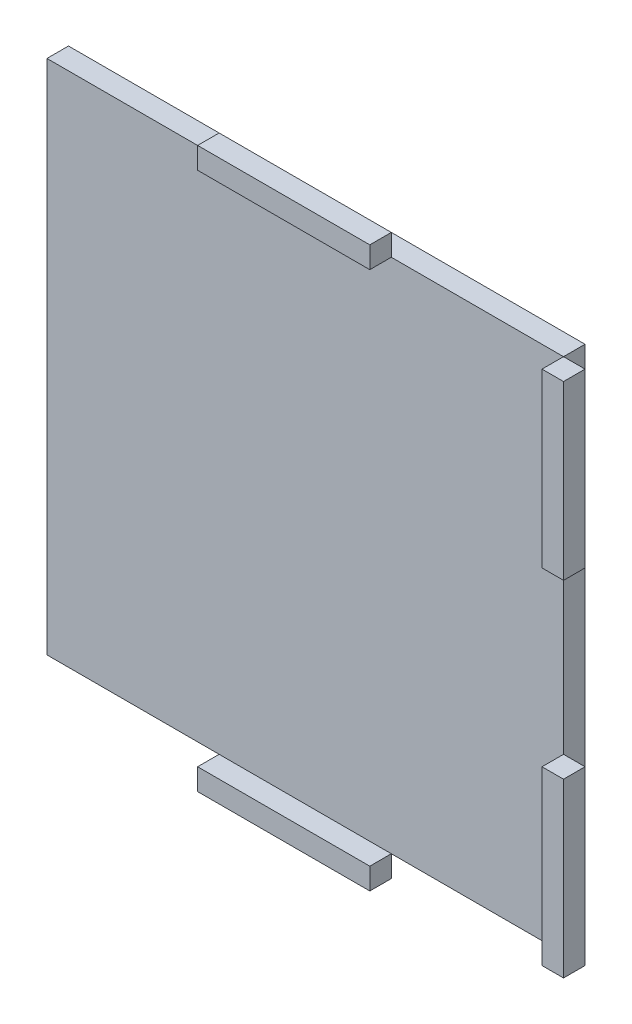
ISO-10303-21;
HEADER;
FILE_DESCRIPTION(('STEP AP214'),'2;1');
FILE_NAME('part.step','',(''),(''),'','','');
FILE_SCHEMA(('AUTOMOTIVE_DESIGN { 1 0 10303 214 1 1 1 1 }'));
ENDSEC;
DATA;
#1=APPLICATION_CONTEXT('core data for automotive mechanical design processes');
#2=APPLICATION_PROTOCOL_DEFINITION('international standard','automotive_design',2000,#1);
#3=PRODUCT_CONTEXT('',#1,'mechanical');
#4=PRODUCT('Part','Part','',(#3));
#5=PRODUCT_RELATED_PRODUCT_CATEGORY('part','',(#4));
#6=PRODUCT_DEFINITION_FORMATION('','',#4);
#7=PRODUCT_DEFINITION_CONTEXT('part definition',#1,'design');
#8=PRODUCT_DEFINITION('design','',#6,#7);
#9=PRODUCT_DEFINITION_SHAPE('','',#8);
#10=(LENGTH_UNIT() NAMED_UNIT(*) SI_UNIT(.MILLI.,.METRE.));
#11=(NAMED_UNIT(*) PLANE_ANGLE_UNIT() SI_UNIT($,.RADIAN.));
#12=(NAMED_UNIT(*) SI_UNIT($,.STERADIAN.) SOLID_ANGLE_UNIT());
#13=UNCERTAINTY_MEASURE_WITH_UNIT(LENGTH_MEASURE(1.E-05),#10,'distance_accuracy_value','');
#14=(GEOMETRIC_REPRESENTATION_CONTEXT(3) GLOBAL_UNCERTAINTY_ASSIGNED_CONTEXT((#13)) GLOBAL_UNIT_ASSIGNED_CONTEXT((#10,
#11,#12)) REPRESENTATION_CONTEXT('',''));
#15=CARTESIAN_POINT('',(0.,0.,0.));
#16=DIRECTION('',(0.,0.,1.));
#17=DIRECTION('',(1.,0.,0.));
#18=AXIS2_PLACEMENT_3D('',#15,#16,#17);
#19=CARTESIAN_POINT('',(-12.7,38.1,6.35));
#20=DIRECTION('',(1.,0.,0.));
#21=DIRECTION('',(0.,0.,-1.));
#22=AXIS2_PLACEMENT_3D('',#19,#20,#21);
#23=PLANE('',#22);
#24=DIRECTION('',(0.,-1.,0.));
#25=VECTOR('',#24,1.);
#26=CARTESIAN_POINT('',(-12.7,38.1,3.175));
#27=LINE('',#26,#25);
#28=CARTESIAN_POINT('',(-12.7,41.275,3.175));
#29=VERTEX_POINT('',#28);
#30=CARTESIAN_POINT('',(-12.7,38.1,3.175));
#31=VERTEX_POINT('',#30);
#32=EDGE_CURVE('E113',#29,#31,#27,.T.);
#33=ORIENTED_EDGE('',*,*,#32,.T.);
#34=DIRECTION('',(0.,0.,-1.));
#35=VECTOR('',#34,1.);
#36=CARTESIAN_POINT('',(-12.7,38.1,6.35));
#37=LINE('',#36,#35);
#38=CARTESIAN_POINT('',(-12.7,38.1,6.35));
#39=VERTEX_POINT('',#38);
#40=EDGE_CURVE('E12',#39,#31,#37,.T.);
#41=ORIENTED_EDGE('',*,*,#40,.F.);
#42=DIRECTION('',(0.,-1.,0.));
#43=VECTOR('',#42,1.);
#44=CARTESIAN_POINT('',(-12.7,38.1,6.35));
#45=LINE('',#44,#43);
#46=CARTESIAN_POINT('',(-12.7,41.275,6.35));
#47=VERTEX_POINT('',#46);
#48=EDGE_CURVE('E101',#47,#39,#45,.T.);
#49=ORIENTED_EDGE('',*,*,#48,.F.);
#50=DIRECTION('',(0.,0.,-1.));
#51=VECTOR('',#50,1.);
#52=CARTESIAN_POINT('',(-12.7,41.275,6.35));
#53=LINE('',#52,#51);
#54=EDGE_CURVE('E109',#47,#29,#53,.T.);
#55=ORIENTED_EDGE('',*,*,#54,.T.);
#56=EDGE_LOOP('',(#33,#41,#49,#55));
#57=FACE_BOUND('',#56,.T.);
#58=ADVANCED_FACE('F50',(#57),#23,.F.);
#59=CARTESIAN_POINT('',(-12.7,38.1,6.35));
#60=DIRECTION('',(0.,1.,0.));
#61=DIRECTION('',(0.,0.,1.));
#62=AXIS2_PLACEMENT_3D('',#59,#60,#61);
#63=PLANE('',#62);
#64=DIRECTION('',(1.,0.,0.));
#65=VECTOR('',#64,1.);
#66=CARTESIAN_POINT('',(-12.7,38.1,3.175));
#67=LINE('',#66,#65);
#68=CARTESIAN_POINT('',(12.7,38.1,3.175));
#69=VERTEX_POINT('',#68);
#70=EDGE_CURVE('E105',#31,#69,#67,.T.);
#71=ORIENTED_EDGE('',*,*,#70,.T.);
#72=DIRECTION('',(0.,0.,-1.));
#73=VECTOR('',#72,1.);
#74=CARTESIAN_POINT('',(12.7,38.1,6.35));
#75=LINE('',#74,#73);
#76=CARTESIAN_POINT('',(12.7,38.1,6.35));
#77=VERTEX_POINT('',#76);
#78=EDGE_CURVE('E58',#77,#69,#75,.T.);
#79=ORIENTED_EDGE('',*,*,#78,.F.);
#80=DIRECTION('',(1.,0.,0.));
#81=VECTOR('',#80,1.);
#82=CARTESIAN_POINT('',(-12.7,38.1,6.35));
#83=LINE('',#82,#81);
#84=EDGE_CURVE('E96',#39,#77,#83,.T.);
#85=ORIENTED_EDGE('',*,*,#84,.F.);
#86=ORIENTED_EDGE('',*,*,#40,.T.);
#87=EDGE_LOOP('',(#71,#79,#85,#86));
#88=FACE_BOUND('',#87,.T.);
#89=ADVANCED_FACE('F104',(#88),#63,.F.);
#90=CARTESIAN_POINT('',(12.7,38.1,6.35));
#91=DIRECTION('',(-1.,0.,0.));
#92=DIRECTION('',(0.,0.,1.));
#93=AXIS2_PLACEMENT_3D('',#90,#91,#92);
#94=PLANE('',#93);
#95=DIRECTION('',(0.,1.,0.));
#96=VECTOR('',#95,1.);
#97=CARTESIAN_POINT('',(12.7,38.1,3.175));
#98=LINE('',#97,#96);
#99=CARTESIAN_POINT('',(12.7,41.275,3.175));
#100=VERTEX_POINT('',#99);
#101=EDGE_CURVE('E83',#69,#100,#98,.T.);
#102=ORIENTED_EDGE('',*,*,#101,.T.);
#103=DIRECTION('',(0.,0.,-1.));
#104=VECTOR('',#103,1.);
#105=CARTESIAN_POINT('',(12.7,41.275,6.35));
#106=LINE('',#105,#104);
#107=CARTESIAN_POINT('',(12.7,41.275,6.35));
#108=VERTEX_POINT('',#107);
#109=EDGE_CURVE('E106',#108,#100,#106,.T.);
#110=ORIENTED_EDGE('',*,*,#109,.F.);
#111=DIRECTION('',(0.,1.,0.));
#112=VECTOR('',#111,1.);
#113=CARTESIAN_POINT('',(12.7,38.1,6.35));
#114=LINE('',#113,#112);
#115=EDGE_CURVE('E99',#77,#108,#114,.T.);
#116=ORIENTED_EDGE('',*,*,#115,.F.);
#117=ORIENTED_EDGE('',*,*,#78,.T.);
#118=EDGE_LOOP('',(#102,#110,#116,#117));
#119=FACE_BOUND('',#118,.T.);
#120=ADVANCED_FACE('F107',(#119),#94,.F.);
#121=CARTESIAN_POINT('',(-12.7,41.275,6.35));
#122=DIRECTION('',(0.,-1.,0.));
#123=DIRECTION('',(0.,0.,-1.));
#124=AXIS2_PLACEMENT_3D('',#121,#122,#123);
#125=PLANE('',#124);
#126=DIRECTION('',(-1.,0.,0.));
#127=VECTOR('',#126,1.);
#128=CARTESIAN_POINT('',(-12.7,41.275,3.175));
#129=LINE('',#128,#127);
#130=EDGE_CURVE('E89',#100,#29,#129,.T.);
#131=ORIENTED_EDGE('',*,*,#130,.T.);
#132=ORIENTED_EDGE('',*,*,#54,.F.);
#133=DIRECTION('',(-1.,0.,0.));
#134=VECTOR('',#133,1.);
#135=CARTESIAN_POINT('',(-12.7,41.275,6.35));
#136=LINE('',#135,#134);
#137=EDGE_CURVE('E66',#108,#47,#136,.T.);
#138=ORIENTED_EDGE('',*,*,#137,.F.);
#139=ORIENTED_EDGE('',*,*,#109,.T.);
#140=EDGE_LOOP('',(#131,#132,#138,#139));
#141=FACE_BOUND('',#140,.T.);
#142=ADVANCED_FACE('F120',(#141),#125,.F.);
#143=CARTESIAN_POINT('',(0.,0.,6.35));
#144=DIRECTION('',(0.,0.,-1.));
#145=DIRECTION('',(-1.,0.,0.));
#146=AXIS2_PLACEMENT_3D('',#143,#144,#145);
#147=PLANE('',#146);
#148=ORIENTED_EDGE('',*,*,#48,.T.);
#149=ORIENTED_EDGE('',*,*,#84,.T.);
#150=ORIENTED_EDGE('',*,*,#115,.T.);
#151=ORIENTED_EDGE('',*,*,#137,.T.);
#152=EDGE_LOOP('',(#148,#149,#150,#151));
#153=FACE_BOUND('',#152,.T.);
#154=ADVANCED_FACE('F97',(#153),#147,.F.);
#155=CARTESIAN_POINT('',(0.,0.,3.175));
#156=DIRECTION('',(0.,0.,-1.));
#157=DIRECTION('',(-1.,0.,0.));
#158=AXIS2_PLACEMENT_3D('',#155,#156,#157);
#159=PLANE('',#158);
#160=ORIENTED_EDGE('',*,*,#32,.F.);
#161=ORIENTED_EDGE('',*,*,#130,.F.);
#162=ORIENTED_EDGE('',*,*,#101,.F.);
#163=ORIENTED_EDGE('',*,*,#70,.F.);
#164=EDGE_LOOP('',(#160,#161,#162,#163));
#165=FACE_BOUND('',#164,.T.);
#166=ADVANCED_FACE('F123',(#165),#159,.T.);
#167=CLOSED_SHELL('',(#58,#89,#120,#142,#154,#166));
#168=MANIFOLD_SOLID_BREP('B2',#167);
#169=CARTESIAN_POINT('',(-12.7,-38.1,6.35));
#170=DIRECTION('',(1.,0.,0.));
#171=DIRECTION('',(0.,0.,-1.));
#172=AXIS2_PLACEMENT_3D('',#169,#170,#171);
#173=PLANE('',#172);
#174=DIRECTION('',(0.,-1.,0.));
#175=VECTOR('',#174,1.);
#176=CARTESIAN_POINT('',(-12.7,-38.1,3.175));
#177=LINE('',#176,#175);
#178=CARTESIAN_POINT('',(-12.7,-38.1,3.175));
#179=VERTEX_POINT('',#178);
#180=CARTESIAN_POINT('',(-12.7,-41.275,3.175));
#181=VERTEX_POINT('',#180);
#182=EDGE_CURVE('E247',#179,#181,#177,.T.);
#183=ORIENTED_EDGE('',*,*,#182,.T.);
#184=DIRECTION('',(0.,0.,-1.));
#185=VECTOR('',#184,1.);
#186=CARTESIAN_POINT('',(-12.7,-41.275,6.35));
#187=LINE('',#186,#185);
#188=CARTESIAN_POINT('',(-12.7,-41.275,6.35));
#189=VERTEX_POINT('',#188);
#190=EDGE_CURVE('E48',#189,#181,#187,.T.);
#191=ORIENTED_EDGE('',*,*,#190,.F.);
#192=DIRECTION('',(0.,-1.,0.));
#193=VECTOR('',#192,1.);
#194=CARTESIAN_POINT('',(-12.7,-38.1,6.35));
#195=LINE('',#194,#193);
#196=CARTESIAN_POINT('',(-12.7,-38.1,6.35));
#197=VERTEX_POINT('',#196);
#198=EDGE_CURVE('E235',#197,#189,#195,.T.);
#199=ORIENTED_EDGE('',*,*,#198,.F.);
#200=DIRECTION('',(0.,0.,-1.));
#201=VECTOR('',#200,1.);
#202=CARTESIAN_POINT('',(-12.7,-38.1,6.35));
#203=LINE('',#202,#201);
#204=EDGE_CURVE('E243',#197,#179,#203,.T.);
#205=ORIENTED_EDGE('',*,*,#204,.T.);
#206=EDGE_LOOP('',(#183,#191,#199,#205));
#207=FACE_BOUND('',#206,.T.);
#208=ADVANCED_FACE('F184',(#207),#173,.F.);
#209=CARTESIAN_POINT('',(-12.7,-41.275,6.35));
#210=DIRECTION('',(0.,1.,0.));
#211=DIRECTION('',(0.,0.,1.));
#212=AXIS2_PLACEMENT_3D('',#209,#210,#211);
#213=PLANE('',#212);
#214=DIRECTION('',(1.,0.,0.));
#215=VECTOR('',#214,1.);
#216=CARTESIAN_POINT('',(-12.7,-41.275,3.175));
#217=LINE('',#216,#215);
#218=CARTESIAN_POINT('',(12.7,-41.275,3.175));
#219=VERTEX_POINT('',#218);
#220=EDGE_CURVE('E239',#181,#219,#217,.T.);
#221=ORIENTED_EDGE('',*,*,#220,.T.);
#222=DIRECTION('',(0.,0.,-1.));
#223=VECTOR('',#222,1.);
#224=CARTESIAN_POINT('',(12.7,-41.275,6.35));
#225=LINE('',#224,#223);
#226=CARTESIAN_POINT('',(12.7,-41.275,6.35));
#227=VERTEX_POINT('',#226);
#228=EDGE_CURVE('E192',#227,#219,#225,.T.);
#229=ORIENTED_EDGE('',*,*,#228,.F.);
#230=DIRECTION('',(1.,0.,0.));
#231=VECTOR('',#230,1.);
#232=CARTESIAN_POINT('',(-12.7,-41.275,6.35));
#233=LINE('',#232,#231);
#234=EDGE_CURVE('E230',#189,#227,#233,.T.);
#235=ORIENTED_EDGE('',*,*,#234,.F.);
#236=ORIENTED_EDGE('',*,*,#190,.T.);
#237=EDGE_LOOP('',(#221,#229,#235,#236));
#238=FACE_BOUND('',#237,.T.);
#239=ADVANCED_FACE('F238',(#238),#213,.F.);
#240=CARTESIAN_POINT('',(12.7,-38.1,6.35));
#241=DIRECTION('',(-1.,0.,0.));
#242=DIRECTION('',(0.,0.,1.));
#243=AXIS2_PLACEMENT_3D('',#240,#241,#242);
#244=PLANE('',#243);
#245=DIRECTION('',(0.,1.,0.));
#246=VECTOR('',#245,1.);
#247=CARTESIAN_POINT('',(12.7,-38.1,3.175));
#248=LINE('',#247,#246);
#249=CARTESIAN_POINT('',(12.7,-38.1,3.175));
#250=VERTEX_POINT('',#249);
#251=EDGE_CURVE('E217',#219,#250,#248,.T.);
#252=ORIENTED_EDGE('',*,*,#251,.T.);
#253=DIRECTION('',(0.,0.,-1.));
#254=VECTOR('',#253,1.);
#255=CARTESIAN_POINT('',(12.7,-38.1,6.35));
#256=LINE('',#255,#254);
#257=CARTESIAN_POINT('',(12.7,-38.1,6.35));
#258=VERTEX_POINT('',#257);
#259=EDGE_CURVE('E240',#258,#250,#256,.T.);
#260=ORIENTED_EDGE('',*,*,#259,.F.);
#261=DIRECTION('',(0.,1.,0.));
#262=VECTOR('',#261,1.);
#263=CARTESIAN_POINT('',(12.7,-38.1,6.35));
#264=LINE('',#263,#262);
#265=EDGE_CURVE('E233',#227,#258,#264,.T.);
#266=ORIENTED_EDGE('',*,*,#265,.F.);
#267=ORIENTED_EDGE('',*,*,#228,.T.);
#268=EDGE_LOOP('',(#252,#260,#266,#267));
#269=FACE_BOUND('',#268,.T.);
#270=ADVANCED_FACE('F241',(#269),#244,.F.);
#271=CARTESIAN_POINT('',(-12.7,-38.1,6.35));
#272=DIRECTION('',(0.,-1.,0.));
#273=DIRECTION('',(0.,0.,-1.));
#274=AXIS2_PLACEMENT_3D('',#271,#272,#273);
#275=PLANE('',#274);
#276=DIRECTION('',(-1.,0.,0.));
#277=VECTOR('',#276,1.);
#278=CARTESIAN_POINT('',(-12.7,-38.1,3.175));
#279=LINE('',#278,#277);
#280=EDGE_CURVE('E223',#250,#179,#279,.T.);
#281=ORIENTED_EDGE('',*,*,#280,.T.);
#282=ORIENTED_EDGE('',*,*,#204,.F.);
#283=DIRECTION('',(-1.,0.,0.));
#284=VECTOR('',#283,1.);
#285=CARTESIAN_POINT('',(-12.7,-38.1,6.35));
#286=LINE('',#285,#284);
#287=EDGE_CURVE('E200',#258,#197,#286,.T.);
#288=ORIENTED_EDGE('',*,*,#287,.F.);
#289=ORIENTED_EDGE('',*,*,#259,.T.);
#290=EDGE_LOOP('',(#281,#282,#288,#289));
#291=FACE_BOUND('',#290,.T.);
#292=ADVANCED_FACE('F254',(#291),#275,.F.);
#293=CARTESIAN_POINT('',(0.,0.,6.35));
#294=DIRECTION('',(0.,0.,1.));
#295=DIRECTION('',(1.,0.,0.));
#296=AXIS2_PLACEMENT_3D('',#293,#294,#295);
#297=PLANE('',#296);
#298=ORIENTED_EDGE('',*,*,#198,.T.);
#299=ORIENTED_EDGE('',*,*,#234,.T.);
#300=ORIENTED_EDGE('',*,*,#265,.T.);
#301=ORIENTED_EDGE('',*,*,#287,.T.);
#302=EDGE_LOOP('',(#298,#299,#300,#301));
#303=FACE_BOUND('',#302,.T.);
#304=ADVANCED_FACE('F231',(#303),#297,.T.);
#305=CARTESIAN_POINT('',(0.,0.,3.175));
#306=DIRECTION('',(0.,0.,1.));
#307=DIRECTION('',(1.,0.,0.));
#308=AXIS2_PLACEMENT_3D('',#305,#306,#307);
#309=PLANE('',#308);
#310=ORIENTED_EDGE('',*,*,#182,.F.);
#311=ORIENTED_EDGE('',*,*,#280,.F.);
#312=ORIENTED_EDGE('',*,*,#251,.F.);
#313=ORIENTED_EDGE('',*,*,#220,.F.);
#314=EDGE_LOOP('',(#310,#311,#312,#313));
#315=FACE_BOUND('',#314,.T.);
#316=ADVANCED_FACE('F257',(#315),#309,.F.);
#317=CLOSED_SHELL('',(#208,#239,#270,#292,#304,#316));
#318=MANIFOLD_SOLID_BREP('B6',#317);
#319=CARTESIAN_POINT('',(38.1,-38.1,6.35));
#320=DIRECTION('',(1.,0.,0.));
#321=DIRECTION('',(0.,0.,-1.));
#322=AXIS2_PLACEMENT_3D('',#319,#320,#321);
#323=PLANE('',#322);
#324=DIRECTION('',(0.,-1.,0.));
#325=VECTOR('',#324,1.);
#326=CARTESIAN_POINT('',(38.1,-38.1,3.175));
#327=LINE('',#326,#325);
#328=CARTESIAN_POINT('',(38.1,-12.7,3.175));
#329=VERTEX_POINT('',#328);
#330=CARTESIAN_POINT('',(38.1,-38.1,3.175));
#331=VERTEX_POINT('',#330);
#332=EDGE_CURVE('E381',#329,#331,#327,.T.);
#333=ORIENTED_EDGE('',*,*,#332,.T.);
#334=DIRECTION('',(0.,0.,-1.));
#335=VECTOR('',#334,1.);
#336=CARTESIAN_POINT('',(38.1,-38.1,6.35));
#337=LINE('',#336,#335);
#338=CARTESIAN_POINT('',(38.1,-38.1,6.35));
#339=VERTEX_POINT('',#338);
#340=EDGE_CURVE('E182',#339,#331,#337,.T.);
#341=ORIENTED_EDGE('',*,*,#340,.F.);
#342=DIRECTION('',(0.,-1.,0.));
#343=VECTOR('',#342,1.);
#344=CARTESIAN_POINT('',(38.1,-38.1,6.35));
#345=LINE('',#344,#343);
#346=CARTESIAN_POINT('',(38.1,-12.7,6.35));
#347=VERTEX_POINT('',#346);
#348=EDGE_CURVE('E369',#347,#339,#345,.T.);
#349=ORIENTED_EDGE('',*,*,#348,.F.);
#350=DIRECTION('',(0.,0.,-1.));
#351=VECTOR('',#350,1.);
#352=CARTESIAN_POINT('',(38.1,-12.7,6.35));
#353=LINE('',#352,#351);
#354=EDGE_CURVE('E377',#347,#329,#353,.T.);
#355=ORIENTED_EDGE('',*,*,#354,.T.);
#356=EDGE_LOOP('',(#333,#341,#349,#355));
#357=FACE_BOUND('',#356,.T.);
#358=ADVANCED_FACE('F318',(#357),#323,.F.);
#359=CARTESIAN_POINT('',(38.1,-38.1,6.35));
#360=DIRECTION('',(0.,1.,0.));
#361=DIRECTION('',(0.,0.,1.));
#362=AXIS2_PLACEMENT_3D('',#359,#360,#361);
#363=PLANE('',#362);
#364=DIRECTION('',(1.,0.,0.));
#365=VECTOR('',#364,1.);
#366=CARTESIAN_POINT('',(38.1,-38.1,3.175));
#367=LINE('',#366,#365);
#368=CARTESIAN_POINT('',(41.275,-38.1,3.175));
#369=VERTEX_POINT('',#368);
#370=EDGE_CURVE('E373',#331,#369,#367,.T.);
#371=ORIENTED_EDGE('',*,*,#370,.T.);
#372=DIRECTION('',(0.,0.,-1.));
#373=VECTOR('',#372,1.);
#374=CARTESIAN_POINT('',(41.275,-38.1,6.35));
#375=LINE('',#374,#373);
#376=CARTESIAN_POINT('',(41.275,-38.1,6.35));
#377=VERTEX_POINT('',#376);
#378=EDGE_CURVE('E326',#377,#369,#375,.T.);
#379=ORIENTED_EDGE('',*,*,#378,.F.);
#380=DIRECTION('',(1.,0.,0.));
#381=VECTOR('',#380,1.);
#382=CARTESIAN_POINT('',(38.1,-38.1,6.35));
#383=LINE('',#382,#381);
#384=EDGE_CURVE('E364',#339,#377,#383,.T.);
#385=ORIENTED_EDGE('',*,*,#384,.F.);
#386=ORIENTED_EDGE('',*,*,#340,.T.);
#387=EDGE_LOOP('',(#371,#379,#385,#386));
#388=FACE_BOUND('',#387,.T.);
#389=ADVANCED_FACE('F372',(#388),#363,.F.);
#390=CARTESIAN_POINT('',(41.275,-38.1,6.35));
#391=DIRECTION('',(-1.,0.,0.));
#392=DIRECTION('',(0.,0.,1.));
#393=AXIS2_PLACEMENT_3D('',#390,#391,#392);
#394=PLANE('',#393);
#395=DIRECTION('',(0.,1.,0.));
#396=VECTOR('',#395,1.);
#397=CARTESIAN_POINT('',(41.275,-38.1,3.175));
#398=LINE('',#397,#396);
#399=CARTESIAN_POINT('',(41.275,-12.7,3.175));
#400=VERTEX_POINT('',#399);
#401=EDGE_CURVE('E351',#369,#400,#398,.T.);
#402=ORIENTED_EDGE('',*,*,#401,.T.);
#403=DIRECTION('',(0.,0.,-1.));
#404=VECTOR('',#403,1.);
#405=CARTESIAN_POINT('',(41.275,-12.7,6.35));
#406=LINE('',#405,#404);
#407=CARTESIAN_POINT('',(41.275,-12.7,6.35));
#408=VERTEX_POINT('',#407);
#409=EDGE_CURVE('E374',#408,#400,#406,.T.);
#410=ORIENTED_EDGE('',*,*,#409,.F.);
#411=DIRECTION('',(0.,1.,0.));
#412=VECTOR('',#411,1.);
#413=CARTESIAN_POINT('',(41.275,-38.1,6.35));
#414=LINE('',#413,#412);
#415=EDGE_CURVE('E367',#377,#408,#414,.T.);
#416=ORIENTED_EDGE('',*,*,#415,.F.);
#417=ORIENTED_EDGE('',*,*,#378,.T.);
#418=EDGE_LOOP('',(#402,#410,#416,#417));
#419=FACE_BOUND('',#418,.T.);
#420=ADVANCED_FACE('F375',(#419),#394,.F.);
#421=CARTESIAN_POINT('',(38.1,-12.7,6.35));
#422=DIRECTION('',(0.,-1.,0.));
#423=DIRECTION('',(0.,0.,-1.));
#424=AXIS2_PLACEMENT_3D('',#421,#422,#423);
#425=PLANE('',#424);
#426=DIRECTION('',(-1.,0.,0.));
#427=VECTOR('',#426,1.);
#428=CARTESIAN_POINT('',(38.1,-12.7,3.175));
#429=LINE('',#428,#427);
#430=EDGE_CURVE('E357',#400,#329,#429,.T.);
#431=ORIENTED_EDGE('',*,*,#430,.T.);
#432=ORIENTED_EDGE('',*,*,#354,.F.);
#433=DIRECTION('',(-1.,0.,0.));
#434=VECTOR('',#433,1.);
#435=CARTESIAN_POINT('',(38.1,-12.7,6.35));
#436=LINE('',#435,#434);
#437=EDGE_CURVE('E334',#408,#347,#436,.T.);
#438=ORIENTED_EDGE('',*,*,#437,.F.);
#439=ORIENTED_EDGE('',*,*,#409,.T.);
#440=EDGE_LOOP('',(#431,#432,#438,#439));
#441=FACE_BOUND('',#440,.T.);
#442=ADVANCED_FACE('F388',(#441),#425,.F.);
#443=CARTESIAN_POINT('',(0.,0.,6.35));
#444=DIRECTION('',(0.,0.,-1.));
#445=DIRECTION('',(-1.,0.,0.));
#446=AXIS2_PLACEMENT_3D('',#443,#444,#445);
#447=PLANE('',#446);
#448=ORIENTED_EDGE('',*,*,#348,.T.);
#449=ORIENTED_EDGE('',*,*,#384,.T.);
#450=ORIENTED_EDGE('',*,*,#415,.T.);
#451=ORIENTED_EDGE('',*,*,#437,.T.);
#452=EDGE_LOOP('',(#448,#449,#450,#451));
#453=FACE_BOUND('',#452,.T.);
#454=ADVANCED_FACE('F365',(#453),#447,.F.);
#455=CARTESIAN_POINT('',(0.,0.,3.175));
#456=DIRECTION('',(0.,0.,-1.));
#457=DIRECTION('',(-1.,0.,0.));
#458=AXIS2_PLACEMENT_3D('',#455,#456,#457);
#459=PLANE('',#458);
#460=ORIENTED_EDGE('',*,*,#332,.F.);
#461=ORIENTED_EDGE('',*,*,#430,.F.);
#462=ORIENTED_EDGE('',*,*,#401,.F.);
#463=ORIENTED_EDGE('',*,*,#370,.F.);
#464=EDGE_LOOP('',(#460,#461,#462,#463));
#465=FACE_BOUND('',#464,.T.);
#466=ADVANCED_FACE('F391',(#465),#459,.T.);
#467=CLOSED_SHELL('',(#358,#389,#420,#442,#454,#466));
#468=MANIFOLD_SOLID_BREP('B42',#467);
#469=CARTESIAN_POINT('',(38.1,38.1,6.35));
#470=DIRECTION('',(1.,0.,0.));
#471=DIRECTION('',(0.,0.,-1.));
#472=AXIS2_PLACEMENT_3D('',#469,#470,#471);
#473=PLANE('',#472);
#474=DIRECTION('',(0.,-1.,0.));
#475=VECTOR('',#474,1.);
#476=CARTESIAN_POINT('',(38.1,38.1,3.175));
#477=LINE('',#476,#475);
#478=CARTESIAN_POINT('',(38.1,38.1,3.175));
#479=VERTEX_POINT('',#478);
#480=CARTESIAN_POINT('',(38.1,12.7,3.175));
#481=VERTEX_POINT('',#480);
#482=EDGE_CURVE('E514',#479,#481,#477,.T.);
#483=ORIENTED_EDGE('',*,*,#482,.T.);
#484=DIRECTION('',(0.,0.,-1.));
#485=VECTOR('',#484,1.);
#486=CARTESIAN_POINT('',(38.1,12.7,6.35));
#487=LINE('',#486,#485);
#488=CARTESIAN_POINT('',(38.1,12.7,6.35));
#489=VERTEX_POINT('',#488);
#490=EDGE_CURVE('E316',#489,#481,#487,.T.);
#491=ORIENTED_EDGE('',*,*,#490,.F.);
#492=DIRECTION('',(0.,-1.,0.));
#493=VECTOR('',#492,1.);
#494=CARTESIAN_POINT('',(38.1,38.1,6.35));
#495=LINE('',#494,#493);
#496=CARTESIAN_POINT('',(38.1,38.1,6.35));
#497=VERTEX_POINT('',#496);
#498=EDGE_CURVE('E502',#497,#489,#495,.T.);
#499=ORIENTED_EDGE('',*,*,#498,.F.);
#500=DIRECTION('',(0.,0.,-1.));
#501=VECTOR('',#500,1.);
#502=CARTESIAN_POINT('',(38.1,38.1,6.35));
#503=LINE('',#502,#501);
#504=EDGE_CURVE('E510',#497,#479,#503,.T.);
#505=ORIENTED_EDGE('',*,*,#504,.T.);
#506=EDGE_LOOP('',(#483,#491,#499,#505));
#507=FACE_BOUND('',#506,.T.);
#508=ADVANCED_FACE('F451',(#507),#473,.F.);
#509=CARTESIAN_POINT('',(38.1,12.7,6.35));
#510=DIRECTION('',(0.,1.,0.));
#511=DIRECTION('',(0.,0.,1.));
#512=AXIS2_PLACEMENT_3D('',#509,#510,#511);
#513=PLANE('',#512);
#514=DIRECTION('',(1.,0.,0.));
#515=VECTOR('',#514,1.);
#516=CARTESIAN_POINT('',(38.1,12.7,3.175));
#517=LINE('',#516,#515);
#518=CARTESIAN_POINT('',(41.275,12.7,3.175));
#519=VERTEX_POINT('',#518);
#520=EDGE_CURVE('E506',#481,#519,#517,.T.);
#521=ORIENTED_EDGE('',*,*,#520,.T.);
#522=DIRECTION('',(0.,0.,-1.));
#523=VECTOR('',#522,1.);
#524=CARTESIAN_POINT('',(41.275,12.7,6.35));
#525=LINE('',#524,#523);
#526=CARTESIAN_POINT('',(41.275,12.7,6.35));
#527=VERTEX_POINT('',#526);
#528=EDGE_CURVE('E459',#527,#519,#525,.T.);
#529=ORIENTED_EDGE('',*,*,#528,.F.);
#530=DIRECTION('',(1.,0.,0.));
#531=VECTOR('',#530,1.);
#532=CARTESIAN_POINT('',(38.1,12.7,6.35));
#533=LINE('',#532,#531);
#534=EDGE_CURVE('E497',#489,#527,#533,.T.);
#535=ORIENTED_EDGE('',*,*,#534,.F.);
#536=ORIENTED_EDGE('',*,*,#490,.T.);
#537=EDGE_LOOP('',(#521,#529,#535,#536));
#538=FACE_BOUND('',#537,.T.);
#539=ADVANCED_FACE('F505',(#538),#513,.F.);
#540=CARTESIAN_POINT('',(41.275,38.1,6.35));
#541=DIRECTION('',(-1.,0.,0.));
#542=DIRECTION('',(0.,0.,1.));
#543=AXIS2_PLACEMENT_3D('',#540,#541,#542);
#544=PLANE('',#543);
#545=DIRECTION('',(0.,1.,0.));
#546=VECTOR('',#545,1.);
#547=CARTESIAN_POINT('',(41.275,38.1,3.175));
#548=LINE('',#547,#546);
#549=CARTESIAN_POINT('',(41.275,38.1,3.175));
#550=VERTEX_POINT('',#549);
#551=EDGE_CURVE('E484',#519,#550,#548,.T.);
#552=ORIENTED_EDGE('',*,*,#551,.T.);
#553=DIRECTION('',(0.,0.,-1.));
#554=VECTOR('',#553,1.);
#555=CARTESIAN_POINT('',(41.275,38.1,6.35));
#556=LINE('',#555,#554);
#557=CARTESIAN_POINT('',(41.275,38.1,6.35));
#558=VERTEX_POINT('',#557);
#559=EDGE_CURVE('E507',#558,#550,#556,.T.);
#560=ORIENTED_EDGE('',*,*,#559,.F.);
#561=DIRECTION('',(0.,1.,0.));
#562=VECTOR('',#561,1.);
#563=CARTESIAN_POINT('',(41.275,38.1,6.35));
#564=LINE('',#563,#562);
#565=EDGE_CURVE('E500',#527,#558,#564,.T.);
#566=ORIENTED_EDGE('',*,*,#565,.F.);
#567=ORIENTED_EDGE('',*,*,#528,.T.);
#568=EDGE_LOOP('',(#552,#560,#566,#567));
#569=FACE_BOUND('',#568,.T.);
#570=ADVANCED_FACE('F508',(#569),#544,.F.);
#571=CARTESIAN_POINT('',(38.1,38.1,6.35));
#572=DIRECTION('',(0.,-1.,0.));
#573=DIRECTION('',(0.,0.,-1.));
#574=AXIS2_PLACEMENT_3D('',#571,#572,#573);
#575=PLANE('',#574);
#576=DIRECTION('',(-1.,0.,0.));
#577=VECTOR('',#576,1.);
#578=CARTESIAN_POINT('',(38.1,38.1,3.175));
#579=LINE('',#578,#577);
#580=EDGE_CURVE('E490',#550,#479,#579,.T.);
#581=ORIENTED_EDGE('',*,*,#580,.T.);
#582=ORIENTED_EDGE('',*,*,#504,.F.);
#583=DIRECTION('',(-1.,0.,0.));
#584=VECTOR('',#583,1.);
#585=CARTESIAN_POINT('',(38.1,38.1,6.35));
#586=LINE('',#585,#584);
#587=EDGE_CURVE('E467',#558,#497,#586,.T.);
#588=ORIENTED_EDGE('',*,*,#587,.F.);
#589=ORIENTED_EDGE('',*,*,#559,.T.);
#590=EDGE_LOOP('',(#581,#582,#588,#589));
#591=FACE_BOUND('',#590,.T.);
#592=ADVANCED_FACE('F521',(#591),#575,.F.);
#593=CARTESIAN_POINT('',(0.,0.,6.35));
#594=DIRECTION('',(0.,0.,1.));
#595=DIRECTION('',(1.,0.,0.));
#596=AXIS2_PLACEMENT_3D('',#593,#594,#595);
#597=PLANE('',#596);
#598=ORIENTED_EDGE('',*,*,#498,.T.);
#599=ORIENTED_EDGE('',*,*,#534,.T.);
#600=ORIENTED_EDGE('',*,*,#565,.T.);
#601=ORIENTED_EDGE('',*,*,#587,.T.);
#602=EDGE_LOOP('',(#598,#599,#600,#601));
#603=FACE_BOUND('',#602,.T.);
#604=ADVANCED_FACE('F498',(#603),#597,.T.);
#605=CARTESIAN_POINT('',(0.,0.,3.175));
#606=DIRECTION('',(0.,0.,1.));
#607=DIRECTION('',(1.,0.,0.));
#608=AXIS2_PLACEMENT_3D('',#605,#606,#607);
#609=PLANE('',#608);
#610=ORIENTED_EDGE('',*,*,#482,.F.);
#611=ORIENTED_EDGE('',*,*,#580,.F.);
#612=ORIENTED_EDGE('',*,*,#551,.F.);
#613=ORIENTED_EDGE('',*,*,#520,.F.);
#614=EDGE_LOOP('',(#610,#611,#612,#613));
#615=FACE_BOUND('',#614,.T.);
#616=ADVANCED_FACE('F524',(#615),#609,.F.);
#617=CLOSED_SHELL('',(#508,#539,#570,#592,#604,#616));
#618=MANIFOLD_SOLID_BREP('B176',#617);
#619=CARTESIAN_POINT('',(38.1,-38.1,3.175));
#620=DIRECTION('',(-1.,0.,0.));
#621=DIRECTION('',(0.,0.,1.));
#622=AXIS2_PLACEMENT_3D('',#619,#620,#621);
#623=PLANE('',#622);
#624=DIRECTION('',(0.,1.,0.));
#625=VECTOR('',#624,1.);
#626=CARTESIAN_POINT('',(38.1,-38.1,0.));
#627=LINE('',#626,#625);
#628=CARTESIAN_POINT('',(38.1,-38.1,0.));
#629=VERTEX_POINT('',#628);
#630=CARTESIAN_POINT('',(38.1,38.1,0.));
#631=VERTEX_POINT('',#630);
#632=EDGE_CURVE('E643',#629,#631,#627,.T.);
#633=ORIENTED_EDGE('',*,*,#632,.T.);
#634=DIRECTION('',(0.,0.,-1.));
#635=VECTOR('',#634,1.);
#636=CARTESIAN_POINT('',(38.1,38.1,3.175));
#637=LINE('',#636,#635);
#638=CARTESIAN_POINT('',(38.1,38.1,3.175));
#639=VERTEX_POINT('',#638);
#640=EDGE_CURVE('E449',#639,#631,#637,.T.);
#641=ORIENTED_EDGE('',*,*,#640,.F.);
#642=DIRECTION('',(0.,1.,0.));
#643=VECTOR('',#642,1.);
#644=CARTESIAN_POINT('',(38.1,-38.1,3.175));
#645=LINE('',#644,#643);
#646=CARTESIAN_POINT('',(38.1,-38.1,3.175));
#647=VERTEX_POINT('',#646);
#648=EDGE_CURVE('E620',#647,#639,#645,.T.);
#649=ORIENTED_EDGE('',*,*,#648,.F.);
#650=DIRECTION('',(0.,0.,-1.));
#651=VECTOR('',#650,1.);
#652=CARTESIAN_POINT('',(38.1,-38.1,3.175));
#653=LINE('',#652,#651);
#654=EDGE_CURVE('E639',#647,#629,#653,.T.);
#655=ORIENTED_EDGE('',*,*,#654,.T.);
#656=EDGE_LOOP('',(#633,#641,#649,#655));
#657=FACE_BOUND('',#656,.T.);
#658=ADVANCED_FACE('F575',(#657),#623,.F.);
#659=CARTESIAN_POINT('',(-38.1,38.1,3.175));
#660=DIRECTION('',(0.,-1.,0.));
#661=DIRECTION('',(0.,0.,-1.));
#662=AXIS2_PLACEMENT_3D('',#659,#660,#661);
#663=PLANE('',#662);
#664=DIRECTION('',(-1.,0.,0.));
#665=VECTOR('',#664,1.);
#666=CARTESIAN_POINT('',(-38.1,38.1,0.));
#667=LINE('',#666,#665);
#668=CARTESIAN_POINT('',(-38.1,38.1,0.));
#669=VERTEX_POINT('',#668);
#670=EDGE_CURVE('E632',#631,#669,#667,.T.);
#671=ORIENTED_EDGE('',*,*,#670,.T.);
#672=DIRECTION('',(0.,0.,-1.));
#673=VECTOR('',#672,1.);
#674=CARTESIAN_POINT('',(-38.1,38.1,3.175));
#675=LINE('',#674,#673);
#676=CARTESIAN_POINT('',(-38.1,38.1,3.175));
#677=VERTEX_POINT('',#676);
#678=EDGE_CURVE('E584',#677,#669,#675,.T.);
#679=ORIENTED_EDGE('',*,*,#678,.F.);
#680=DIRECTION('',(-1.,0.,0.));
#681=VECTOR('',#680,1.);
#682=CARTESIAN_POINT('',(-38.1,38.1,3.175));
#683=LINE('',#682,#681);
#684=EDGE_CURVE('E622',#639,#677,#683,.T.);
#685=ORIENTED_EDGE('',*,*,#684,.F.);
#686=ORIENTED_EDGE('',*,*,#640,.T.);
#687=EDGE_LOOP('',(#671,#679,#685,#686));
#688=FACE_BOUND('',#687,.T.);
#689=ADVANCED_FACE('F631',(#688),#663,.F.);
#690=CARTESIAN_POINT('',(-38.1,-38.1,3.175));
#691=DIRECTION('',(1.,0.,0.));
#692=DIRECTION('',(0.,0.,-1.));
#693=AXIS2_PLACEMENT_3D('',#690,#691,#692);
#694=PLANE('',#693);
#695=DIRECTION('',(0.,-1.,0.));
#696=VECTOR('',#695,1.);
#697=CARTESIAN_POINT('',(-38.1,-38.1,0.));
#698=LINE('',#697,#696);
#699=CARTESIAN_POINT('',(-38.1,-38.1,0.));
#700=VERTEX_POINT('',#699);
#701=EDGE_CURVE('E609',#669,#700,#698,.T.);
#702=ORIENTED_EDGE('',*,*,#701,.T.);
#703=DIRECTION('',(0.,0.,-1.));
#704=VECTOR('',#703,1.);
#705=CARTESIAN_POINT('',(-38.1,-38.1,3.175));
#706=LINE('',#705,#704);
#707=CARTESIAN_POINT('',(-38.1,-38.1,3.175));
#708=VERTEX_POINT('',#707);
#709=EDGE_CURVE('E634',#708,#700,#706,.T.);
#710=ORIENTED_EDGE('',*,*,#709,.F.);
#711=DIRECTION('',(0.,-1.,0.));
#712=VECTOR('',#711,1.);
#713=CARTESIAN_POINT('',(-38.1,-38.1,3.175));
#714=LINE('',#713,#712);
#715=EDGE_CURVE('E626',#677,#708,#714,.T.);
#716=ORIENTED_EDGE('',*,*,#715,.F.);
#717=ORIENTED_EDGE('',*,*,#678,.T.);
#718=EDGE_LOOP('',(#702,#710,#716,#717));
#719=FACE_BOUND('',#718,.T.);
#720=ADVANCED_FACE('F635',(#719),#694,.F.);
#721=CARTESIAN_POINT('',(-38.1,-38.1,3.175));
#722=DIRECTION('',(0.,1.,0.));
#723=DIRECTION('',(0.,0.,1.));
#724=AXIS2_PLACEMENT_3D('',#721,#722,#723);
#725=PLANE('',#724);
#726=DIRECTION('',(1.,0.,0.));
#727=VECTOR('',#726,1.);
#728=CARTESIAN_POINT('',(-38.1,-38.1,0.));
#729=LINE('',#728,#727);
#730=EDGE_CURVE('E615',#700,#629,#729,.T.);
#731=ORIENTED_EDGE('',*,*,#730,.T.);
#732=ORIENTED_EDGE('',*,*,#654,.F.);
#733=DIRECTION('',(1.,0.,0.));
#734=VECTOR('',#733,1.);
#735=CARTESIAN_POINT('',(-38.1,-38.1,3.175));
#736=LINE('',#735,#734);
#737=EDGE_CURVE('E592',#708,#647,#736,.T.);
#738=ORIENTED_EDGE('',*,*,#737,.F.);
#739=ORIENTED_EDGE('',*,*,#709,.T.);
#740=EDGE_LOOP('',(#731,#732,#738,#739));
#741=FACE_BOUND('',#740,.T.);
#742=ADVANCED_FACE('F656',(#741),#725,.F.);
#743=CARTESIAN_POINT('',(0.,0.,3.175));
#744=DIRECTION('',(0.,0.,-1.));
#745=DIRECTION('',(-1.,0.,0.));
#746=AXIS2_PLACEMENT_3D('',#743,#744,#745);
#747=PLANE('',#746);
#748=ORIENTED_EDGE('',*,*,#648,.T.);
#749=ORIENTED_EDGE('',*,*,#684,.T.);
#750=ORIENTED_EDGE('',*,*,#715,.T.);
#751=ORIENTED_EDGE('',*,*,#737,.T.);
#752=EDGE_LOOP('',(#748,#749,#750,#751));
#753=FACE_BOUND('',#752,.T.);
#754=ADVANCED_FACE('F624',(#753),#747,.F.);
#755=CARTESIAN_POINT('',(0.,0.,0.));
#756=DIRECTION('',(0.,0.,-1.));
#757=DIRECTION('',(-1.,0.,0.));
#758=AXIS2_PLACEMENT_3D('',#755,#756,#757);
#759=PLANE('',#758);
#760=ORIENTED_EDGE('',*,*,#632,.F.);
#761=ORIENTED_EDGE('',*,*,#730,.F.);
#762=ORIENTED_EDGE('',*,*,#701,.F.);
#763=ORIENTED_EDGE('',*,*,#670,.F.);
#764=EDGE_LOOP('',(#760,#761,#762,#763));
#765=FACE_BOUND('',#764,.T.);
#766=ADVANCED_FACE('F659',(#765),#759,.T.);
#767=CLOSED_SHELL('',(#658,#689,#720,#742,#754,#766));
#768=MANIFOLD_SOLID_BREP('B310',#767);
#769=ADVANCED_BREP_SHAPE_REPRESENTATION('',(#18,#168,#318,#468,#618,#768),#14);
#770=SHAPE_DEFINITION_REPRESENTATION(#9,#769);
ENDSEC;
END-ISO-10303-21;
